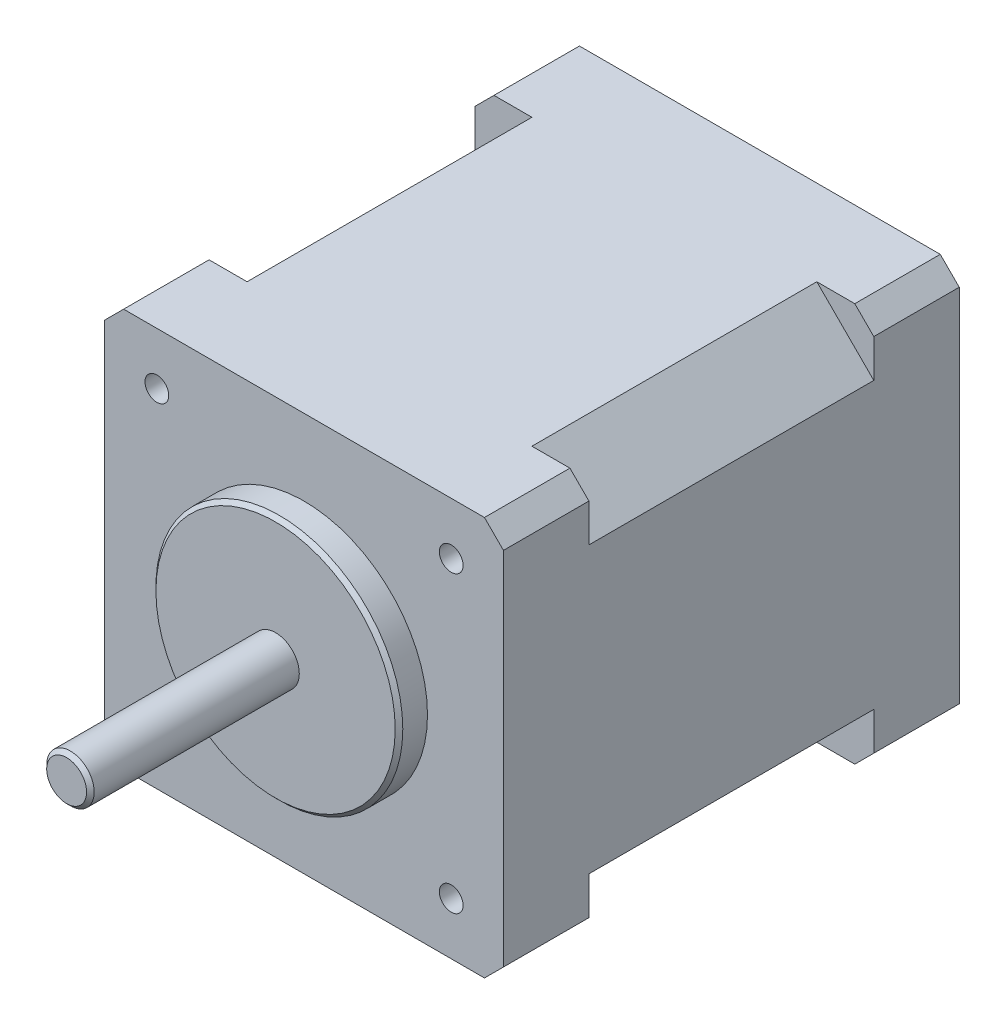
ISO-10303-21;
HEADER;
FILE_DESCRIPTION(('STEP AP214'),'2;1');
FILE_NAME('part.step','',(''),(''),'','','');
FILE_SCHEMA(('AUTOMOTIVE_DESIGN { 1 0 10303 214 1 1 1 1 }'));
ENDSEC;
DATA;
#1=APPLICATION_CONTEXT('core data for automotive mechanical design processes');
#2=APPLICATION_PROTOCOL_DEFINITION('international standard','automotive_design',2000,#1);
#3=PRODUCT_CONTEXT('',#1,'mechanical');
#4=PRODUCT('Part','Part','',(#3));
#5=PRODUCT_RELATED_PRODUCT_CATEGORY('part','',(#4));
#6=PRODUCT_DEFINITION_FORMATION('','',#4);
#7=PRODUCT_DEFINITION_CONTEXT('part definition',#1,'design');
#8=PRODUCT_DEFINITION('design','',#6,#7);
#9=PRODUCT_DEFINITION_SHAPE('','',#8);
#10=(LENGTH_UNIT() NAMED_UNIT(*) SI_UNIT(.MILLI.,.METRE.));
#11=(NAMED_UNIT(*) PLANE_ANGLE_UNIT() SI_UNIT($,.RADIAN.));
#12=(NAMED_UNIT(*) SI_UNIT($,.STERADIAN.) SOLID_ANGLE_UNIT());
#13=UNCERTAINTY_MEASURE_WITH_UNIT(LENGTH_MEASURE(1.E-05),#10,'distance_accuracy_value','');
#14=(GEOMETRIC_REPRESENTATION_CONTEXT(3) GLOBAL_UNCERTAINTY_ASSIGNED_CONTEXT((#13)) GLOBAL_UNIT_ASSIGNED_CONTEXT((#10,
#11,#12)) REPRESENTATION_CONTEXT('',''));
#15=CARTESIAN_POINT('',(0.,0.,0.));
#16=DIRECTION('',(0.,0.,1.));
#17=DIRECTION('',(1.,0.,0.));
#18=AXIS2_PLACEMENT_3D('',#15,#16,#17);
#19=CARTESIAN_POINT('',(-21.,-21.,48.));
#20=DIRECTION('',(0.,1.,0.));
#21=DIRECTION('',(0.,0.,1.));
#22=AXIS2_PLACEMENT_3D('',#19,#20,#21);
#23=PLANE('',#22);
#24=DIRECTION('',(-1.,0.,0.));
#25=VECTOR('',#24,1.);
#26=CARTESIAN_POINT('',(-21.,-21.,39.));
#27=LINE('',#26,#25);
#28=CARTESIAN_POINT('',(-15.,-21.,39.));
#29=VERTEX_POINT('',#28);
#30=CARTESIAN_POINT('',(-19.,-21.,39.));
#31=VERTEX_POINT('',#30);
#32=EDGE_CURVE('E208',#29,#31,#27,.T.);
#33=ORIENTED_EDGE('',*,*,#32,.F.);
#34=DIRECTION('',(0.,0.,-1.));
#35=VECTOR('',#34,1.);
#36=CARTESIAN_POINT('',(-15.,-21.,39.));
#37=LINE('',#36,#35);
#38=CARTESIAN_POINT('',(-15.,-21.,9.));
#39=VERTEX_POINT('',#38);
#40=EDGE_CURVE('E215',#29,#39,#37,.T.);
#41=ORIENTED_EDGE('',*,*,#40,.T.);
#42=DIRECTION('',(-1.,0.,0.));
#43=VECTOR('',#42,1.);
#44=CARTESIAN_POINT('',(-21.,-21.,9.));
#45=LINE('',#44,#43);
#46=CARTESIAN_POINT('',(-19.,-21.,9.));
#47=VERTEX_POINT('',#46);
#48=EDGE_CURVE('E411',#39,#47,#45,.T.);
#49=ORIENTED_EDGE('',*,*,#48,.T.);
#50=DIRECTION('',(0.,0.,-1.));
#51=VECTOR('',#50,1.);
#52=CARTESIAN_POINT('',(-19.,-21.,48.));
#53=LINE('',#52,#51);
#54=CARTESIAN_POINT('',(-19.,-21.,0.));
#55=VERTEX_POINT('',#54);
#56=EDGE_CURVE('E340',#47,#55,#53,.T.);
#57=ORIENTED_EDGE('',*,*,#56,.T.);
#58=DIRECTION('',(1.,0.,0.));
#59=VECTOR('',#58,1.);
#60=CARTESIAN_POINT('',(-21.,-21.,0.));
#61=LINE('',#60,#59);
#62=CARTESIAN_POINT('',(19.,-21.,0.));
#63=VERTEX_POINT('',#62);
#64=EDGE_CURVE('E329',#55,#63,#61,.T.);
#65=ORIENTED_EDGE('',*,*,#64,.T.);
#66=DIRECTION('',(0.,0.,1.));
#67=VECTOR('',#66,1.);
#68=CARTESIAN_POINT('',(19.,-21.,48.));
#69=LINE('',#68,#67);
#70=CARTESIAN_POINT('',(19.,-21.,9.));
#71=VERTEX_POINT('',#70);
#72=EDGE_CURVE('E337',#63,#71,#69,.T.);
#73=ORIENTED_EDGE('',*,*,#72,.T.);
#74=DIRECTION('',(-1.,0.,0.));
#75=VECTOR('',#74,1.);
#76=CARTESIAN_POINT('',(15.,-21.,9.));
#77=LINE('',#76,#75);
#78=CARTESIAN_POINT('',(15.,-21.,9.));
#79=VERTEX_POINT('',#78);
#80=EDGE_CURVE('E60',#71,#79,#77,.T.);
#81=ORIENTED_EDGE('',*,*,#80,.T.);
#82=DIRECTION('',(0.,0.,-1.));
#83=VECTOR('',#82,1.);
#84=CARTESIAN_POINT('',(15.,-21.,39.));
#85=LINE('',#84,#83);
#86=CARTESIAN_POINT('',(15.,-21.,39.));
#87=VERTEX_POINT('',#86);
#88=EDGE_CURVE('E232',#87,#79,#85,.T.);
#89=ORIENTED_EDGE('',*,*,#88,.F.);
#90=DIRECTION('',(-1.,0.,0.));
#91=VECTOR('',#90,1.);
#92=CARTESIAN_POINT('',(15.,-21.,39.));
#93=LINE('',#92,#91);
#94=CARTESIAN_POINT('',(19.,-21.,39.));
#95=VERTEX_POINT('',#94);
#96=EDGE_CURVE('E226',#95,#87,#93,.T.);
#97=ORIENTED_EDGE('',*,*,#96,.F.);
#98=CARTESIAN_POINT('',(19.,-21.,48.));
#99=VERTEX_POINT('',#98);
#100=EDGE_CURVE('E326',#95,#99,#69,.T.);
#101=ORIENTED_EDGE('',*,*,#100,.T.);
#102=DIRECTION('',(1.,0.,0.));
#103=VECTOR('',#102,1.);
#104=CARTESIAN_POINT('',(-21.,-21.,48.));
#105=LINE('',#104,#103);
#106=CARTESIAN_POINT('',(-19.,-21.,48.));
#107=VERTEX_POINT('',#106);
#108=EDGE_CURVE('E316',#107,#99,#105,.T.);
#109=ORIENTED_EDGE('',*,*,#108,.F.);
#110=EDGE_CURVE('E341',#107,#31,#53,.T.);
#111=ORIENTED_EDGE('',*,*,#110,.T.);
#112=EDGE_LOOP('',(#33,#41,#49,#57,#65,#73,#81,#89,#97,#101,#109,#111));
#113=FACE_BOUND('',#112,.T.);
#114=ADVANCED_FACE('F37',(#113),#23,.F.);
#115=CARTESIAN_POINT('',(-21.,21.,48.));
#116=DIRECTION('',(1.,0.,0.));
#117=DIRECTION('',(0.,1.,0.));
#118=AXIS2_PLACEMENT_3D('',#115,#116,#117);
#119=PLANE('',#118);
#120=DIRECTION('',(0.,1.,0.));
#121=VECTOR('',#120,1.);
#122=CARTESIAN_POINT('',(-21.,-15.,39.));
#123=LINE('',#122,#121);
#124=CARTESIAN_POINT('',(-21.,-19.,39.));
#125=VERTEX_POINT('',#124);
#126=CARTESIAN_POINT('',(-21.,-15.,39.));
#127=VERTEX_POINT('',#126);
#128=EDGE_CURVE('E200',#125,#127,#123,.T.);
#129=ORIENTED_EDGE('',*,*,#128,.F.);
#130=DIRECTION('',(0.,0.,1.));
#131=VECTOR('',#130,1.);
#132=CARTESIAN_POINT('',(-21.,-19.,48.));
#133=LINE('',#132,#131);
#134=CARTESIAN_POINT('',(-21.,-19.,48.));
#135=VERTEX_POINT('',#134);
#136=EDGE_CURVE('E356',#125,#135,#133,.T.);
#137=ORIENTED_EDGE('',*,*,#136,.T.);
#138=DIRECTION('',(0.,-1.,0.));
#139=VECTOR('',#138,1.);
#140=CARTESIAN_POINT('',(-21.,21.,48.));
#141=LINE('',#140,#139);
#142=CARTESIAN_POINT('',(-21.,19.,48.));
#143=VERTEX_POINT('',#142);
#144=EDGE_CURVE('E313',#143,#135,#141,.T.);
#145=ORIENTED_EDGE('',*,*,#144,.F.);
#146=DIRECTION('',(0.,0.,-1.));
#147=VECTOR('',#146,1.);
#148=CARTESIAN_POINT('',(-21.,19.,48.));
#149=LINE('',#148,#147);
#150=CARTESIAN_POINT('',(-21.,19.,39.));
#151=VERTEX_POINT('',#150);
#152=EDGE_CURVE('E353',#143,#151,#149,.T.);
#153=ORIENTED_EDGE('',*,*,#152,.T.);
#154=DIRECTION('',(0.,1.,0.));
#155=VECTOR('',#154,1.);
#156=CARTESIAN_POINT('',(-21.,15.,39.));
#157=LINE('',#156,#155);
#158=CARTESIAN_POINT('',(-21.,15.,39.));
#159=VERTEX_POINT('',#158);
#160=EDGE_CURVE('E249',#159,#151,#157,.T.);
#161=ORIENTED_EDGE('',*,*,#160,.F.);
#162=DIRECTION('',(0.,0.,-1.));
#163=VECTOR('',#162,1.);
#164=CARTESIAN_POINT('',(-21.,15.,39.));
#165=LINE('',#164,#163);
#166=CARTESIAN_POINT('',(-21.,15.,9.));
#167=VERTEX_POINT('',#166);
#168=EDGE_CURVE('E258',#159,#167,#165,.T.);
#169=ORIENTED_EDGE('',*,*,#168,.T.);
#170=DIRECTION('',(0.,1.,0.));
#171=VECTOR('',#170,1.);
#172=CARTESIAN_POINT('',(-21.,15.,9.));
#173=LINE('',#172,#171);
#174=CARTESIAN_POINT('',(-21.,19.,9.));
#175=VERTEX_POINT('',#174);
#176=EDGE_CURVE('E246',#167,#175,#173,.T.);
#177=ORIENTED_EDGE('',*,*,#176,.T.);
#178=CARTESIAN_POINT('',(-21.,19.,0.));
#179=VERTEX_POINT('',#178);
#180=EDGE_CURVE('E352',#175,#179,#149,.T.);
#181=ORIENTED_EDGE('',*,*,#180,.T.);
#182=DIRECTION('',(0.,-1.,0.));
#183=VECTOR('',#182,1.);
#184=CARTESIAN_POINT('',(-21.,21.,0.));
#185=LINE('',#184,#183);
#186=CARTESIAN_POINT('',(-21.,-19.,0.));
#187=VERTEX_POINT('',#186);
#188=EDGE_CURVE('E312',#179,#187,#185,.T.);
#189=ORIENTED_EDGE('',*,*,#188,.T.);
#190=CARTESIAN_POINT('',(-21.,-19.,9.));
#191=VERTEX_POINT('',#190);
#192=EDGE_CURVE('E357',#187,#191,#133,.T.);
#193=ORIENTED_EDGE('',*,*,#192,.T.);
#194=DIRECTION('',(0.,1.,0.));
#195=VECTOR('',#194,1.);
#196=CARTESIAN_POINT('',(-21.,-15.,9.));
#197=LINE('',#196,#195);
#198=CARTESIAN_POINT('',(-21.,-15.,9.));
#199=VERTEX_POINT('',#198);
#200=EDGE_CURVE('E52',#191,#199,#197,.T.);
#201=ORIENTED_EDGE('',*,*,#200,.T.);
#202=DIRECTION('',(0.,0.,-1.));
#203=VECTOR('',#202,1.);
#204=CARTESIAN_POINT('',(-21.,-15.,39.));
#205=LINE('',#204,#203);
#206=EDGE_CURVE('E213',#127,#199,#205,.T.);
#207=ORIENTED_EDGE('',*,*,#206,.F.);
#208=EDGE_LOOP('',(#129,#137,#145,#153,#161,#169,#177,#181,#189,#193,#201,#207));
#209=FACE_BOUND('',#208,.T.);
#210=ADVANCED_FACE('F217',(#209),#119,.F.);
#211=CARTESIAN_POINT('',(-19.,-21.,48.));
#212=DIRECTION('',(0.707106781186547,0.707106781186547,0.));
#213=DIRECTION('',(0.,0.,-1.));
#214=AXIS2_PLACEMENT_3D('',#211,#212,#213);
#215=PLANE('',#214);
#216=ORIENTED_EDGE('',*,*,#136,.F.);
#217=DIRECTION('',(-0.707106781186548,0.707106781186548,0.));
#218=VECTOR('',#217,1.);
#219=CARTESIAN_POINT('',(-19.,-21.,39.));
#220=LINE('',#219,#218);
#221=EDGE_CURVE('E11',#125,#31,#220,.F.);
#222=ORIENTED_EDGE('',*,*,#221,.T.);
#223=ORIENTED_EDGE('',*,*,#110,.F.);
#224=DIRECTION('',(-0.707106781186548,0.707106781186548,0.));
#225=VECTOR('',#224,1.);
#226=CARTESIAN_POINT('',(-20.,-20.,48.));
#227=LINE('',#226,#225);
#228=EDGE_CURVE('E365',#135,#107,#227,.F.);
#229=ORIENTED_EDGE('',*,*,#228,.F.);
#230=EDGE_LOOP('',(#216,#222,#223,#229));
#231=FACE_BOUND('',#230,.T.);
#232=ADVANCED_FACE('F474',(#231),#215,.F.);
#233=CARTESIAN_POINT('',(21.,21.,48.));
#234=DIRECTION('',(-1.,0.,0.));
#235=DIRECTION('',(0.,-1.,0.));
#236=AXIS2_PLACEMENT_3D('',#233,#234,#235);
#237=PLANE('',#236);
#238=DIRECTION('',(0.,-1.,0.));
#239=VECTOR('',#238,1.);
#240=CARTESIAN_POINT('',(21.,-21.,39.));
#241=LINE('',#240,#239);
#242=CARTESIAN_POINT('',(21.,-15.,39.));
#243=VERTEX_POINT('',#242);
#244=CARTESIAN_POINT('',(21.,-19.,39.));
#245=VERTEX_POINT('',#244);
#246=EDGE_CURVE('E224',#243,#245,#241,.T.);
#247=ORIENTED_EDGE('',*,*,#246,.F.);
#248=DIRECTION('',(0.,0.,-1.));
#249=VECTOR('',#248,1.);
#250=CARTESIAN_POINT('',(21.,-15.,39.));
#251=LINE('',#250,#249);
#252=CARTESIAN_POINT('',(21.,-15.,9.));
#253=VERTEX_POINT('',#252);
#254=EDGE_CURVE('E238',#243,#253,#251,.T.);
#255=ORIENTED_EDGE('',*,*,#254,.T.);
#256=DIRECTION('',(0.,-1.,0.));
#257=VECTOR('',#256,1.);
#258=CARTESIAN_POINT('',(21.,-21.,9.));
#259=LINE('',#258,#257);
#260=CARTESIAN_POINT('',(21.,-19.,9.));
#261=VERTEX_POINT('',#260);
#262=EDGE_CURVE('E220',#253,#261,#259,.T.);
#263=ORIENTED_EDGE('',*,*,#262,.T.);
#264=DIRECTION('',(0.,0.,-1.));
#265=VECTOR('',#264,1.);
#266=CARTESIAN_POINT('',(21.,-19.,48.));
#267=LINE('',#266,#265);
#268=CARTESIAN_POINT('',(21.,-19.,0.));
#269=VERTEX_POINT('',#268);
#270=EDGE_CURVE('E371',#261,#269,#267,.T.);
#271=ORIENTED_EDGE('',*,*,#270,.T.);
#272=DIRECTION('',(0.,1.,0.));
#273=VECTOR('',#272,1.);
#274=CARTESIAN_POINT('',(21.,21.,0.));
#275=LINE('',#274,#273);
#276=CARTESIAN_POINT('',(21.,19.,0.));
#277=VERTEX_POINT('',#276);
#278=EDGE_CURVE('E332',#269,#277,#275,.T.);
#279=ORIENTED_EDGE('',*,*,#278,.T.);
#280=DIRECTION('',(0.,0.,1.));
#281=VECTOR('',#280,1.);
#282=CARTESIAN_POINT('',(21.,19.,48.));
#283=LINE('',#282,#281);
#284=CARTESIAN_POINT('',(21.,19.,9.));
#285=VERTEX_POINT('',#284);
#286=EDGE_CURVE('E368',#277,#285,#283,.T.);
#287=ORIENTED_EDGE('',*,*,#286,.T.);
#288=DIRECTION('',(0.,-1.,0.));
#289=VECTOR('',#288,1.);
#290=CARTESIAN_POINT('',(21.,21.,9.));
#291=LINE('',#290,#289);
#292=CARTESIAN_POINT('',(21.,15.,9.));
#293=VERTEX_POINT('',#292);
#294=EDGE_CURVE('E261',#285,#293,#291,.T.);
#295=ORIENTED_EDGE('',*,*,#294,.T.);
#296=DIRECTION('',(0.,0.,-1.));
#297=VECTOR('',#296,1.);
#298=CARTESIAN_POINT('',(21.,15.,39.));
#299=LINE('',#298,#297);
#300=CARTESIAN_POINT('',(21.,15.,39.));
#301=VERTEX_POINT('',#300);
#302=EDGE_CURVE('E271',#301,#293,#299,.T.);
#303=ORIENTED_EDGE('',*,*,#302,.F.);
#304=DIRECTION('',(0.,-1.,0.));
#305=VECTOR('',#304,1.);
#306=CARTESIAN_POINT('',(21.,21.,39.));
#307=LINE('',#306,#305);
#308=CARTESIAN_POINT('',(21.,19.,39.));
#309=VERTEX_POINT('',#308);
#310=EDGE_CURVE('E263',#309,#301,#307,.T.);
#311=ORIENTED_EDGE('',*,*,#310,.F.);
#312=CARTESIAN_POINT('',(21.,19.,48.));
#313=VERTEX_POINT('',#312);
#314=EDGE_CURVE('E367',#309,#313,#283,.T.);
#315=ORIENTED_EDGE('',*,*,#314,.T.);
#316=DIRECTION('',(0.,1.,0.));
#317=VECTOR('',#316,1.);
#318=CARTESIAN_POINT('',(21.,21.,48.));
#319=LINE('',#318,#317);
#320=CARTESIAN_POINT('',(21.,-19.,48.));
#321=VERTEX_POINT('',#320);
#322=EDGE_CURVE('E320',#321,#313,#319,.T.);
#323=ORIENTED_EDGE('',*,*,#322,.F.);
#324=EDGE_CURVE('E372',#321,#245,#267,.T.);
#325=ORIENTED_EDGE('',*,*,#324,.T.);
#326=EDGE_LOOP('',(#247,#255,#263,#271,#279,#287,#295,#303,#311,#315,#323,#325));
#327=FACE_BOUND('',#326,.T.);
#328=ADVANCED_FACE('F432',(#327),#237,.F.);
#329=CARTESIAN_POINT('',(21.,-19.,48.));
#330=DIRECTION('',(-0.707106781186548,0.707106781186548,0.));
#331=DIRECTION('',(0.,0.,-1.));
#332=AXIS2_PLACEMENT_3D('',#329,#330,#331);
#333=PLANE('',#332);
#334=ORIENTED_EDGE('',*,*,#100,.F.);
#335=DIRECTION('',(-0.707106781186548,-0.707106781186548,0.));
#336=VECTOR('',#335,1.);
#337=CARTESIAN_POINT('',(21.,-19.,39.));
#338=LINE('',#337,#336);
#339=EDGE_CURVE('E407',#95,#245,#338,.F.);
#340=ORIENTED_EDGE('',*,*,#339,.T.);
#341=ORIENTED_EDGE('',*,*,#324,.F.);
#342=DIRECTION('',(-0.707106781186548,-0.707106781186548,0.));
#343=VECTOR('',#342,1.);
#344=CARTESIAN_POINT('',(20.,-20.,48.));
#345=LINE('',#344,#343);
#346=EDGE_CURVE('E363',#99,#321,#345,.F.);
#347=ORIENTED_EDGE('',*,*,#346,.F.);
#348=EDGE_LOOP('',(#334,#340,#341,#347));
#349=FACE_BOUND('',#348,.T.);
#350=ADVANCED_FACE('F444',(#349),#333,.F.);
#351=CARTESIAN_POINT('',(-21.,19.,48.));
#352=DIRECTION('',(0.707106781186547,-0.707106781186547,0.));
#353=DIRECTION('',(0.,0.,-1.));
#354=AXIS2_PLACEMENT_3D('',#351,#352,#353);
#355=PLANE('',#354);
#356=ORIENTED_EDGE('',*,*,#180,.F.);
#357=DIRECTION('',(-0.707106781186548,-0.707106781186548,0.));
#358=VECTOR('',#357,1.);
#359=CARTESIAN_POINT('',(-21.,19.,9.));
#360=LINE('',#359,#358);
#361=CARTESIAN_POINT('',(-19.,21.,9.));
#362=VERTEX_POINT('',#361);
#363=EDGE_CURVE('E400',#175,#362,#360,.F.);
#364=ORIENTED_EDGE('',*,*,#363,.T.);
#365=DIRECTION('',(0.,0.,1.));
#366=VECTOR('',#365,1.);
#367=CARTESIAN_POINT('',(-19.,21.,48.));
#368=LINE('',#367,#366);
#369=CARTESIAN_POINT('',(-19.,21.,0.));
#370=VERTEX_POINT('',#369);
#371=EDGE_CURVE('E380',#370,#362,#368,.T.);
#372=ORIENTED_EDGE('',*,*,#371,.F.);
#373=DIRECTION('',(-0.707106781186548,-0.707106781186548,0.));
#374=VECTOR('',#373,1.);
#375=CARTESIAN_POINT('',(-21.,19.,0.));
#376=LINE('',#375,#374);
#377=EDGE_CURVE('E346',#179,#370,#376,.F.);
#378=ORIENTED_EDGE('',*,*,#377,.F.);
#379=EDGE_LOOP('',(#356,#364,#372,#378));
#380=FACE_BOUND('',#379,.T.);
#381=ADVANCED_FACE('F668',(#380),#355,.F.);
#382=CARTESIAN_POINT('',(19.,21.,48.));
#383=DIRECTION('',(-0.707106781186547,-0.707106781186547,0.));
#384=DIRECTION('',(0.,0.,-1.));
#385=AXIS2_PLACEMENT_3D('',#382,#383,#384);
#386=PLANE('',#385);
#387=DIRECTION('',(0.,0.,-1.));
#388=VECTOR('',#387,1.);
#389=CARTESIAN_POINT('',(19.,21.,48.));
#390=LINE('',#389,#388);
#391=CARTESIAN_POINT('',(19.,21.,9.));
#392=VERTEX_POINT('',#391);
#393=CARTESIAN_POINT('',(19.,21.,0.));
#394=VERTEX_POINT('',#393);
#395=EDGE_CURVE('E375',#392,#394,#390,.T.);
#396=ORIENTED_EDGE('',*,*,#395,.F.);
#397=DIRECTION('',(-0.707106781186548,0.707106781186548,0.));
#398=VECTOR('',#397,1.);
#399=CARTESIAN_POINT('',(19.,21.,9.));
#400=LINE('',#399,#398);
#401=EDGE_CURVE('E395',#392,#285,#400,.F.);
#402=ORIENTED_EDGE('',*,*,#401,.T.);
#403=ORIENTED_EDGE('',*,*,#286,.F.);
#404=DIRECTION('',(-0.707106781186548,0.707106781186548,0.));
#405=VECTOR('',#404,1.);
#406=CARTESIAN_POINT('',(19.,21.,0.));
#407=LINE('',#406,#405);
#408=EDGE_CURVE('E344',#394,#277,#407,.F.);
#409=ORIENTED_EDGE('',*,*,#408,.F.);
#410=EDGE_LOOP('',(#396,#402,#403,#409));
#411=FACE_BOUND('',#410,.T.);
#412=ADVANCED_FACE('F510',(#411),#386,.F.);
#413=CARTESIAN_POINT('',(0.,0.,51.));
#414=DIRECTION('',(0.,0.,1.));
#415=DIRECTION('',(1.,0.,0.));
#416=AXIS2_PLACEMENT_3D('',#413,#414,#415);
#417=PLANE('',#416);
#418=CARTESIAN_POINT('',(0.,0.,51.));
#419=DIRECTION('',(0.,0.,1.));
#420=DIRECTION('',(1.,0.,0.));
#421=AXIS2_PLACEMENT_3D('',#418,#419,#420);
#422=CIRCLE('',#421,12.6);
#423=CARTESIAN_POINT('',(12.6,0.,51.));
#424=VERTEX_POINT('',#423);
#425=EDGE_CURVE('E389',#424,#424,#422,.T.);
#426=ORIENTED_EDGE('',*,*,#425,.T.);
#427=EDGE_LOOP('',(#426));
#428=FACE_BOUND('',#427,.T.);
#429=CARTESIAN_POINT('',(0.,0.,51.));
#430=DIRECTION('',(0.,0.,1.));
#431=DIRECTION('',(1.,0.,0.));
#432=AXIS2_PLACEMENT_3D('',#429,#430,#431);
#433=CIRCLE('',#432,2.5);
#434=CARTESIAN_POINT('',(2.5,0.,51.));
#435=VERTEX_POINT('',#434);
#436=EDGE_CURVE('E281',#435,#435,#433,.T.);
#437=ORIENTED_EDGE('',*,*,#436,.F.);
#438=EDGE_LOOP('',(#437));
#439=FACE_BOUND('',#438,.T.);
#440=ADVANCED_FACE('F501',(#428,#439),#417,.T.);
#441=CARTESIAN_POINT('',(0.,0.,48.));
#442=DIRECTION('',(0.,0.,1.));
#443=DIRECTION('',(1.,0.,0.));
#444=AXIS2_PLACEMENT_3D('',#441,#442,#443);
#445=PLANE('',#444);
#446=CARTESIAN_POINT('',(-15.5,15.5,48.));
#447=DIRECTION('',(0.,0.,1.));
#448=DIRECTION('',(1.,0.,0.));
#449=AXIS2_PLACEMENT_3D('',#446,#447,#448);
#450=CIRCLE('',#449,1.24999999999999);
#451=CARTESIAN_POINT('',(-14.25,15.5,48.));
#452=VERTEX_POINT('',#451);
#453=EDGE_CURVE('E285',#452,#452,#450,.T.);
#454=ORIENTED_EDGE('',*,*,#453,.F.);
#455=EDGE_LOOP('',(#454));
#456=FACE_BOUND('',#455,.T.);
#457=CARTESIAN_POINT('',(-15.5,-15.5,48.));
#458=DIRECTION('',(0.,0.,1.));
#459=DIRECTION('',(1.,0.,0.));
#460=AXIS2_PLACEMENT_3D('',#457,#458,#459);
#461=CIRCLE('',#460,1.24999999999999);
#462=CARTESIAN_POINT('',(-14.25,-15.5,48.));
#463=VERTEX_POINT('',#462);
#464=EDGE_CURVE('E291',#463,#463,#461,.T.);
#465=ORIENTED_EDGE('',*,*,#464,.F.);
#466=EDGE_LOOP('',(#465));
#467=FACE_BOUND('',#466,.T.);
#468=CARTESIAN_POINT('',(15.5,-15.5,48.));
#469=DIRECTION('',(0.,0.,1.));
#470=DIRECTION('',(1.,0.,0.));
#471=AXIS2_PLACEMENT_3D('',#468,#469,#470);
#472=CIRCLE('',#471,1.24999999999999);
#473=CARTESIAN_POINT('',(16.75,-15.5,48.));
#474=VERTEX_POINT('',#473);
#475=EDGE_CURVE('E297',#474,#474,#472,.T.);
#476=ORIENTED_EDGE('',*,*,#475,.F.);
#477=EDGE_LOOP('',(#476));
#478=FACE_BOUND('',#477,.T.);
#479=CARTESIAN_POINT('',(15.5,15.5,48.));
#480=DIRECTION('',(0.,0.,1.));
#481=DIRECTION('',(1.,0.,0.));
#482=AXIS2_PLACEMENT_3D('',#479,#480,#481);
#483=CIRCLE('',#482,1.24999999999999);
#484=CARTESIAN_POINT('',(16.75,15.5,48.));
#485=VERTEX_POINT('',#484);
#486=EDGE_CURVE('E303',#485,#485,#483,.T.);
#487=ORIENTED_EDGE('',*,*,#486,.F.);
#488=EDGE_LOOP('',(#487));
#489=FACE_BOUND('',#488,.T.);
#490=ORIENTED_EDGE('',*,*,#144,.T.);
#491=ORIENTED_EDGE('',*,*,#228,.T.);
#492=ORIENTED_EDGE('',*,*,#108,.T.);
#493=ORIENTED_EDGE('',*,*,#346,.T.);
#494=ORIENTED_EDGE('',*,*,#322,.T.);
#495=DIRECTION('',(0.707106781186548,-0.707106781186548,0.));
#496=VECTOR('',#495,1.);
#497=CARTESIAN_POINT('',(20.,20.,48.));
#498=LINE('',#497,#496);
#499=CARTESIAN_POINT('',(19.,21.,48.));
#500=VERTEX_POINT('',#499);
#501=EDGE_CURVE('E359',#313,#500,#498,.F.);
#502=ORIENTED_EDGE('',*,*,#501,.T.);
#503=DIRECTION('',(-1.,0.,0.));
#504=VECTOR('',#503,1.);
#505=CARTESIAN_POINT('',(-21.,21.,48.));
#506=LINE('',#505,#504);
#507=CARTESIAN_POINT('',(-19.,21.,48.));
#508=VERTEX_POINT('',#507);
#509=EDGE_CURVE('E323',#500,#508,#506,.T.);
#510=ORIENTED_EDGE('',*,*,#509,.T.);
#511=DIRECTION('',(0.707106781186548,0.707106781186548,0.));
#512=VECTOR('',#511,1.);
#513=CARTESIAN_POINT('',(-20.,20.,48.));
#514=LINE('',#513,#512);
#515=EDGE_CURVE('E361',#508,#143,#514,.F.);
#516=ORIENTED_EDGE('',*,*,#515,.T.);
#517=EDGE_LOOP('',(#490,#491,#492,#493,#494,#502,#510,#516));
#518=FACE_BOUND('',#517,.T.);
#519=CARTESIAN_POINT('',(0.,0.,48.));
#520=DIRECTION('',(0.,0.,1.));
#521=DIRECTION('',(1.,0.,0.));
#522=AXIS2_PLACEMENT_3D('',#519,#520,#521);
#523=CIRCLE('',#522,13.);
#524=CARTESIAN_POINT('',(13.,0.,48.));
#525=VERTEX_POINT('',#524);
#526=EDGE_CURVE('E309',#525,#525,#523,.T.);
#527=ORIENTED_EDGE('',*,*,#526,.F.);
#528=EDGE_LOOP('',(#527));
#529=FACE_BOUND('',#528,.T.);
#530=ADVANCED_FACE('F448',(#456,#467,#478,#489,#518,#529),#445,.T.);
#531=CARTESIAN_POINT('',(-21.,21.,48.));
#532=DIRECTION('',(0.,-1.,0.));
#533=DIRECTION('',(1.,0.,0.));
#534=AXIS2_PLACEMENT_3D('',#531,#532,#533);
#535=PLANE('',#534);
#536=DIRECTION('',(0.,0.,-1.));
#537=VECTOR('',#536,1.);
#538=CARTESIAN_POINT('',(-15.,21.,39.));
#539=LINE('',#538,#537);
#540=CARTESIAN_POINT('',(-15.,21.,39.));
#541=VERTEX_POINT('',#540);
#542=CARTESIAN_POINT('',(-15.,21.,9.));
#543=VERTEX_POINT('',#542);
#544=EDGE_CURVE('E251',#541,#543,#539,.T.);
#545=ORIENTED_EDGE('',*,*,#544,.F.);
#546=DIRECTION('',(1.,0.,0.));
#547=VECTOR('',#546,1.);
#548=CARTESIAN_POINT('',(-21.,21.,39.));
#549=LINE('',#548,#547);
#550=CARTESIAN_POINT('',(-19.,21.,39.));
#551=VERTEX_POINT('',#550);
#552=EDGE_CURVE('E243',#551,#541,#549,.T.);
#553=ORIENTED_EDGE('',*,*,#552,.F.);
#554=EDGE_CURVE('E379',#551,#508,#368,.T.);
#555=ORIENTED_EDGE('',*,*,#554,.T.);
#556=ORIENTED_EDGE('',*,*,#509,.F.);
#557=CARTESIAN_POINT('',(19.,21.,39.));
#558=VERTEX_POINT('',#557);
#559=EDGE_CURVE('E376',#500,#558,#390,.T.);
#560=ORIENTED_EDGE('',*,*,#559,.T.);
#561=DIRECTION('',(1.,0.,0.));
#562=VECTOR('',#561,1.);
#563=CARTESIAN_POINT('',(15.,21.,39.));
#564=LINE('',#563,#562);
#565=CARTESIAN_POINT('',(15.,21.,39.));
#566=VERTEX_POINT('',#565);
#567=EDGE_CURVE('E269',#566,#558,#564,.T.);
#568=ORIENTED_EDGE('',*,*,#567,.F.);
#569=DIRECTION('',(0.,0.,-1.));
#570=VECTOR('',#569,1.);
#571=CARTESIAN_POINT('',(15.,21.,39.));
#572=LINE('',#571,#570);
#573=CARTESIAN_POINT('',(15.,21.,9.));
#574=VERTEX_POINT('',#573);
#575=EDGE_CURVE('E278',#566,#574,#572,.T.);
#576=ORIENTED_EDGE('',*,*,#575,.T.);
#577=DIRECTION('',(1.,0.,0.));
#578=VECTOR('',#577,1.);
#579=CARTESIAN_POINT('',(15.,21.,9.));
#580=LINE('',#579,#578);
#581=EDGE_CURVE('E266',#574,#392,#580,.T.);
#582=ORIENTED_EDGE('',*,*,#581,.T.);
#583=ORIENTED_EDGE('',*,*,#395,.T.);
#584=DIRECTION('',(-1.,0.,0.));
#585=VECTOR('',#584,1.);
#586=CARTESIAN_POINT('',(-21.,21.,0.));
#587=LINE('',#586,#585);
#588=EDGE_CURVE('E317',#394,#370,#587,.T.);
#589=ORIENTED_EDGE('',*,*,#588,.T.);
#590=ORIENTED_EDGE('',*,*,#371,.T.);
#591=DIRECTION('',(1.,0.,0.));
#592=VECTOR('',#591,1.);
#593=CARTESIAN_POINT('',(-21.,21.,9.));
#594=LINE('',#593,#592);
#595=EDGE_CURVE('E241',#362,#543,#594,.T.);
#596=ORIENTED_EDGE('',*,*,#595,.T.);
#597=EDGE_LOOP('',(#545,#553,#555,#556,#560,#568,#576,#582,#583,#589,#590,#596));
#598=FACE_BOUND('',#597,.T.);
#599=ADVANCED_FACE('F462',(#598),#535,.F.);
#600=CARTESIAN_POINT('',(0.,0.,0.));
#601=DIRECTION('',(0.,0.,1.));
#602=DIRECTION('',(1.,0.,0.));
#603=AXIS2_PLACEMENT_3D('',#600,#601,#602);
#604=PLANE('',#603);
#605=CARTESIAN_POINT('',(-15.5,15.5,0.));
#606=DIRECTION('',(0.,0.,1.));
#607=DIRECTION('',(1.,0.,0.));
#608=AXIS2_PLACEMENT_3D('',#605,#606,#607);
#609=CIRCLE('',#608,1.24999999999999);
#610=CARTESIAN_POINT('',(-14.25,15.5,0.));
#611=VERTEX_POINT('',#610);
#612=EDGE_CURVE('E288',#611,#611,#609,.T.);
#613=ORIENTED_EDGE('',*,*,#612,.T.);
#614=EDGE_LOOP('',(#613));
#615=FACE_BOUND('',#614,.T.);
#616=CARTESIAN_POINT('',(-15.5,-15.5,0.));
#617=DIRECTION('',(0.,0.,1.));
#618=DIRECTION('',(1.,0.,0.));
#619=AXIS2_PLACEMENT_3D('',#616,#617,#618);
#620=CIRCLE('',#619,1.24999999999999);
#621=CARTESIAN_POINT('',(-14.25,-15.5,0.));
#622=VERTEX_POINT('',#621);
#623=EDGE_CURVE('E294',#622,#622,#620,.T.);
#624=ORIENTED_EDGE('',*,*,#623,.T.);
#625=EDGE_LOOP('',(#624));
#626=FACE_BOUND('',#625,.T.);
#627=CARTESIAN_POINT('',(15.5,-15.5,0.));
#628=DIRECTION('',(0.,0.,1.));
#629=DIRECTION('',(1.,0.,0.));
#630=AXIS2_PLACEMENT_3D('',#627,#628,#629);
#631=CIRCLE('',#630,1.24999999999999);
#632=CARTESIAN_POINT('',(16.75,-15.5,0.));
#633=VERTEX_POINT('',#632);
#634=EDGE_CURVE('E300',#633,#633,#631,.T.);
#635=ORIENTED_EDGE('',*,*,#634,.T.);
#636=EDGE_LOOP('',(#635));
#637=FACE_BOUND('',#636,.T.);
#638=CARTESIAN_POINT('',(15.5,15.5,0.));
#639=DIRECTION('',(0.,0.,1.));
#640=DIRECTION('',(1.,0.,0.));
#641=AXIS2_PLACEMENT_3D('',#638,#639,#640);
#642=CIRCLE('',#641,1.24999999999999);
#643=CARTESIAN_POINT('',(16.75,15.5,0.));
#644=VERTEX_POINT('',#643);
#645=EDGE_CURVE('E306',#644,#644,#642,.T.);
#646=ORIENTED_EDGE('',*,*,#645,.T.);
#647=EDGE_LOOP('',(#646));
#648=FACE_BOUND('',#647,.T.);
#649=ORIENTED_EDGE('',*,*,#64,.F.);
#650=DIRECTION('',(0.707106781186548,-0.707106781186548,0.));
#651=VECTOR('',#650,1.);
#652=CARTESIAN_POINT('',(-19.,-21.,0.));
#653=LINE('',#652,#651);
#654=EDGE_CURVE('E350',#55,#187,#653,.F.);
#655=ORIENTED_EDGE('',*,*,#654,.T.);
#656=ORIENTED_EDGE('',*,*,#188,.F.);
#657=ORIENTED_EDGE('',*,*,#377,.T.);
#658=ORIENTED_EDGE('',*,*,#588,.F.);
#659=ORIENTED_EDGE('',*,*,#408,.T.);
#660=ORIENTED_EDGE('',*,*,#278,.F.);
#661=DIRECTION('',(0.707106781186548,0.707106781186548,0.));
#662=VECTOR('',#661,1.);
#663=CARTESIAN_POINT('',(21.,-19.,0.));
#664=LINE('',#663,#662);
#665=EDGE_CURVE('E348',#269,#63,#664,.F.);
#666=ORIENTED_EDGE('',*,*,#665,.T.);
#667=EDGE_LOOP('',(#649,#655,#656,#657,#658,#659,#660,#666));
#668=FACE_BOUND('',#667,.T.);
#669=ADVANCED_FACE('F422',(#615,#626,#637,#648,#668),#604,.F.);
#670=DIRECTION('',(-0.707106781186548,0.707106781186548,0.));
#671=VECTOR('',#670,1.);
#672=CARTESIAN_POINT('',(-19.,-21.,9.));
#673=LINE('',#672,#671);
#674=EDGE_CURVE('E45',#191,#47,#673,.F.);
#675=ORIENTED_EDGE('',*,*,#674,.F.);
#676=ORIENTED_EDGE('',*,*,#192,.F.);
#677=ORIENTED_EDGE('',*,*,#654,.F.);
#678=ORIENTED_EDGE('',*,*,#56,.F.);
#679=EDGE_LOOP('',(#675,#676,#677,#678));
#680=FACE_BOUND('',#679,.T.);
#681=ADVANCED_FACE('F418',(#680),#215,.F.);
#682=DIRECTION('',(-0.707106781186548,-0.707106781186548,0.));
#683=VECTOR('',#682,1.);
#684=CARTESIAN_POINT('',(21.,-19.,9.));
#685=LINE('',#684,#683);
#686=EDGE_CURVE('E405',#71,#261,#685,.F.);
#687=ORIENTED_EDGE('',*,*,#686,.F.);
#688=ORIENTED_EDGE('',*,*,#72,.F.);
#689=ORIENTED_EDGE('',*,*,#665,.F.);
#690=ORIENTED_EDGE('',*,*,#270,.F.);
#691=EDGE_LOOP('',(#687,#688,#689,#690));
#692=FACE_BOUND('',#691,.T.);
#693=ADVANCED_FACE('F427',(#692),#333,.F.);
#694=DIRECTION('',(-0.707106781186548,-0.707106781186548,0.));
#695=VECTOR('',#694,1.);
#696=CARTESIAN_POINT('',(-21.,19.,39.));
#697=LINE('',#696,#695);
#698=EDGE_CURVE('E403',#151,#551,#697,.F.);
#699=ORIENTED_EDGE('',*,*,#698,.F.);
#700=ORIENTED_EDGE('',*,*,#152,.F.);
#701=ORIENTED_EDGE('',*,*,#515,.F.);
#702=ORIENTED_EDGE('',*,*,#554,.F.);
#703=EDGE_LOOP('',(#699,#700,#701,#702));
#704=FACE_BOUND('',#703,.T.);
#705=ADVANCED_FACE('F468',(#704),#355,.F.);
#706=DIRECTION('',(-0.707106781186548,0.707106781186548,0.));
#707=VECTOR('',#706,1.);
#708=CARTESIAN_POINT('',(19.,21.,39.));
#709=LINE('',#708,#707);
#710=EDGE_CURVE('E398',#558,#309,#709,.F.);
#711=ORIENTED_EDGE('',*,*,#710,.F.);
#712=ORIENTED_EDGE('',*,*,#559,.F.);
#713=ORIENTED_EDGE('',*,*,#501,.F.);
#714=ORIENTED_EDGE('',*,*,#314,.F.);
#715=EDGE_LOOP('',(#711,#712,#713,#714));
#716=FACE_BOUND('',#715,.T.);
#717=ADVANCED_FACE('F456',(#716),#386,.F.);
#718=CARTESIAN_POINT('',(0.,0.,51.));
#719=DIRECTION('',(0.,0.,-1.));
#720=DIRECTION('',(-1.,0.,0.));
#721=AXIS2_PLACEMENT_3D('',#718,#719,#720);
#722=CYLINDRICAL_SURFACE('',#721,13.);
#723=CARTESIAN_POINT('',(0.,0.,50.6));
#724=DIRECTION('',(0.,0.,1.));
#725=DIRECTION('',(1.,0.,0.));
#726=AXIS2_PLACEMENT_3D('',#723,#724,#725);
#727=CIRCLE('',#726,13.);
#728=CARTESIAN_POINT('',(13.,0.,50.6));
#729=VERTEX_POINT('',#728);
#730=EDGE_CURVE('E392',#729,#729,#727,.F.);
#731=ORIENTED_EDGE('',*,*,#730,.T.);
#732=EDGE_LOOP('',(#731));
#733=FACE_BOUND('',#732,.T.);
#734=ORIENTED_EDGE('',*,*,#526,.T.);
#735=EDGE_LOOP('',(#734));
#736=FACE_BOUND('',#735,.T.);
#737=ADVANCED_FACE('F503',(#733,#736),#722,.T.);
#738=CARTESIAN_POINT('',(15.5,15.5,48.));
#739=DIRECTION('',(0.,0.,1.));
#740=DIRECTION('',(1.,0.,0.));
#741=AXIS2_PLACEMENT_3D('',#738,#739,#740);
#742=CYLINDRICAL_SURFACE('',#741,1.24999999999999);
#743=ORIENTED_EDGE('',*,*,#645,.F.);
#744=EDGE_LOOP('',(#743));
#745=FACE_BOUND('',#744,.T.);
#746=ORIENTED_EDGE('',*,*,#486,.T.);
#747=EDGE_LOOP('',(#746));
#748=FACE_BOUND('',#747,.T.);
#749=ADVANCED_FACE('F506',(#745,#748),#742,.F.);
#750=CARTESIAN_POINT('',(15.5,-15.5,48.));
#751=DIRECTION('',(0.,0.,1.));
#752=DIRECTION('',(1.,0.,0.));
#753=AXIS2_PLACEMENT_3D('',#750,#751,#752);
#754=CYLINDRICAL_SURFACE('',#753,1.24999999999999);
#755=ORIENTED_EDGE('',*,*,#634,.F.);
#756=EDGE_LOOP('',(#755));
#757=FACE_BOUND('',#756,.T.);
#758=ORIENTED_EDGE('',*,*,#475,.T.);
#759=EDGE_LOOP('',(#758));
#760=FACE_BOUND('',#759,.T.);
#761=ADVANCED_FACE('F514',(#757,#760),#754,.F.);
#762=CARTESIAN_POINT('',(-15.5,-15.5,48.));
#763=DIRECTION('',(0.,0.,1.));
#764=DIRECTION('',(1.,0.,0.));
#765=AXIS2_PLACEMENT_3D('',#762,#763,#764);
#766=CYLINDRICAL_SURFACE('',#765,1.24999999999999);
#767=ORIENTED_EDGE('',*,*,#623,.F.);
#768=EDGE_LOOP('',(#767));
#769=FACE_BOUND('',#768,.T.);
#770=ORIENTED_EDGE('',*,*,#464,.T.);
#771=EDGE_LOOP('',(#770));
#772=FACE_BOUND('',#771,.T.);
#773=ADVANCED_FACE('F518',(#769,#772),#766,.F.);
#774=CARTESIAN_POINT('',(-15.5,15.5,48.));
#775=DIRECTION('',(0.,0.,1.));
#776=DIRECTION('',(1.,0.,0.));
#777=AXIS2_PLACEMENT_3D('',#774,#775,#776);
#778=CYLINDRICAL_SURFACE('',#777,1.24999999999999);
#779=ORIENTED_EDGE('',*,*,#612,.F.);
#780=EDGE_LOOP('',(#779));
#781=FACE_BOUND('',#780,.T.);
#782=ORIENTED_EDGE('',*,*,#453,.T.);
#783=EDGE_LOOP('',(#782));
#784=FACE_BOUND('',#783,.T.);
#785=ADVANCED_FACE('F522',(#781,#784),#778,.F.);
#786=CARTESIAN_POINT('',(0.,0.,73.));
#787=DIRECTION('',(0.,0.,-1.));
#788=DIRECTION('',(-1.,0.,0.));
#789=AXIS2_PLACEMENT_3D('',#786,#787,#788);
#790=CYLINDRICAL_SURFACE('',#789,2.5);
#791=CARTESIAN_POINT('',(0.,0.,72.6));
#792=DIRECTION('',(0.,0.,1.));
#793=DIRECTION('',(1.,0.,0.));
#794=AXIS2_PLACEMENT_3D('',#791,#792,#793);
#795=CIRCLE('',#794,2.5);
#796=CARTESIAN_POINT('',(2.5,0.,72.6));
#797=VERTEX_POINT('',#796);
#798=EDGE_CURVE('E386',#797,#797,#795,.F.);
#799=ORIENTED_EDGE('',*,*,#798,.T.);
#800=EDGE_LOOP('',(#799));
#801=FACE_BOUND('',#800,.T.);
#802=ORIENTED_EDGE('',*,*,#436,.T.);
#803=EDGE_LOOP('',(#802));
#804=FACE_BOUND('',#803,.T.);
#805=ADVANCED_FACE('F526',(#801,#804),#790,.T.);
#806=CARTESIAN_POINT('',(0.,0.,73.));
#807=DIRECTION('',(0.,0.,1.));
#808=DIRECTION('',(1.,0.,0.));
#809=AXIS2_PLACEMENT_3D('',#806,#807,#808);
#810=PLANE('',#809);
#811=CARTESIAN_POINT('',(0.,0.,73.));
#812=DIRECTION('',(0.,0.,1.));
#813=DIRECTION('',(1.,0.,0.));
#814=AXIS2_PLACEMENT_3D('',#811,#812,#813);
#815=CIRCLE('',#814,2.09999999999999);
#816=CARTESIAN_POINT('',(2.09999999999999,0.,73.));
#817=VERTEX_POINT('',#816);
#818=EDGE_CURVE('E383',#817,#817,#815,.T.);
#819=ORIENTED_EDGE('',*,*,#818,.T.);
#820=EDGE_LOOP('',(#819));
#821=FACE_BOUND('',#820,.T.);
#822=ADVANCED_FACE('F530',(#821),#810,.T.);
#823=CARTESIAN_POINT('',(0.,0.,73.));
#824=DIRECTION('',(0.,0.,-1.));
#825=DIRECTION('',(-1.,0.,0.));
#826=AXIS2_PLACEMENT_3D('',#823,#824,#825);
#827=CONICAL_SURFACE('',#826,2.09999999999999,0.785398163397463);
#828=ORIENTED_EDGE('',*,*,#798,.F.);
#829=EDGE_LOOP('',(#828));
#830=FACE_BOUND('',#829,.T.);
#831=ORIENTED_EDGE('',*,*,#818,.F.);
#832=EDGE_LOOP('',(#831));
#833=FACE_BOUND('',#832,.T.);
#834=ADVANCED_FACE('F534',(#830,#833),#827,.T.);
#835=CARTESIAN_POINT('',(0.,0.,51.));
#836=DIRECTION('',(0.,0.,-1.));
#837=DIRECTION('',(-1.,0.,0.));
#838=AXIS2_PLACEMENT_3D('',#835,#836,#837);
#839=CONICAL_SURFACE('',#838,12.6,0.785398163397435);
#840=ORIENTED_EDGE('',*,*,#730,.F.);
#841=EDGE_LOOP('',(#840));
#842=FACE_BOUND('',#841,.T.);
#843=ORIENTED_EDGE('',*,*,#425,.F.);
#844=EDGE_LOOP('',(#843));
#845=FACE_BOUND('',#844,.T.);
#846=ADVANCED_FACE('F39',(#842,#845),#839,.T.);
#847=CARTESIAN_POINT('',(21.,15.,39.));
#848=DIRECTION('',(-0.707106781186547,-0.707106781186548,0.));
#849=DIRECTION('',(0.707106781186548,-0.707106781186547,0.));
#850=AXIS2_PLACEMENT_3D('',#847,#848,#849);
#851=PLANE('',#850);
#852=DIRECTION('',(-0.707106781186548,0.707106781186547,0.));
#853=VECTOR('',#852,1.);
#854=CARTESIAN_POINT('',(21.,15.,9.));
#855=LINE('',#854,#853);
#856=EDGE_CURVE('E274',#293,#574,#855,.T.);
#857=ORIENTED_EDGE('',*,*,#856,.T.);
#858=ORIENTED_EDGE('',*,*,#575,.F.);
#859=DIRECTION('',(-0.707106781186548,0.707106781186547,0.));
#860=VECTOR('',#859,1.);
#861=CARTESIAN_POINT('',(21.,15.,39.));
#862=LINE('',#861,#860);
#863=EDGE_CURVE('E265',#301,#566,#862,.T.);
#864=ORIENTED_EDGE('',*,*,#863,.F.);
#865=ORIENTED_EDGE('',*,*,#302,.T.);
#866=EDGE_LOOP('',(#857,#858,#864,#865));
#867=FACE_BOUND('',#866,.T.);
#868=ADVANCED_FACE('F536',(#867),#851,.F.);
#869=CARTESIAN_POINT('',(0.,0.,39.));
#870=DIRECTION('',(0.,0.,1.));
#871=DIRECTION('',(1.,0.,0.));
#872=AXIS2_PLACEMENT_3D('',#869,#870,#871);
#873=PLANE('',#872);
#874=ORIENTED_EDGE('',*,*,#710,.T.);
#875=ORIENTED_EDGE('',*,*,#310,.T.);
#876=ORIENTED_EDGE('',*,*,#863,.T.);
#877=ORIENTED_EDGE('',*,*,#567,.T.);
#878=EDGE_LOOP('',(#874,#875,#876,#877));
#879=FACE_BOUND('',#878,.T.);
#880=ADVANCED_FACE('F539',(#879),#873,.F.);
#881=CARTESIAN_POINT('',(0.,0.,9.));
#882=DIRECTION('',(0.,0.,1.));
#883=DIRECTION('',(1.,0.,0.));
#884=AXIS2_PLACEMENT_3D('',#881,#882,#883);
#885=PLANE('',#884);
#886=ORIENTED_EDGE('',*,*,#581,.F.);
#887=ORIENTED_EDGE('',*,*,#856,.F.);
#888=ORIENTED_EDGE('',*,*,#294,.F.);
#889=ORIENTED_EDGE('',*,*,#401,.F.);
#890=EDGE_LOOP('',(#886,#887,#888,#889));
#891=FACE_BOUND('',#890,.T.);
#892=ADVANCED_FACE('F541',(#891),#885,.T.);
#893=CARTESIAN_POINT('',(-15.,21.,39.));
#894=DIRECTION('',(0.707106781186547,-0.707106781186547,0.));
#895=DIRECTION('',(0.707106781186548,0.707106781186548,0.));
#896=AXIS2_PLACEMENT_3D('',#893,#894,#895);
#897=PLANE('',#896);
#898=DIRECTION('',(-0.707106781186548,-0.707106781186548,0.));
#899=VECTOR('',#898,1.);
#900=CARTESIAN_POINT('',(-15.,21.,9.));
#901=LINE('',#900,#899);
#902=EDGE_CURVE('E254',#543,#167,#901,.T.);
#903=ORIENTED_EDGE('',*,*,#902,.T.);
#904=ORIENTED_EDGE('',*,*,#168,.F.);
#905=DIRECTION('',(-0.707106781186548,-0.707106781186548,0.));
#906=VECTOR('',#905,1.);
#907=CARTESIAN_POINT('',(-15.,21.,39.));
#908=LINE('',#907,#906);
#909=EDGE_CURVE('E245',#541,#159,#908,.T.);
#910=ORIENTED_EDGE('',*,*,#909,.F.);
#911=ORIENTED_EDGE('',*,*,#544,.T.);
#912=EDGE_LOOP('',(#903,#904,#910,#911));
#913=FACE_BOUND('',#912,.T.);
#914=ADVANCED_FACE('F544',(#913),#897,.F.);
#915=CARTESIAN_POINT('',(0.,0.,39.));
#916=DIRECTION('',(0.,0.,1.));
#917=DIRECTION('',(1.,0.,0.));
#918=AXIS2_PLACEMENT_3D('',#915,#916,#917);
#919=PLANE('',#918);
#920=ORIENTED_EDGE('',*,*,#698,.T.);
#921=ORIENTED_EDGE('',*,*,#552,.T.);
#922=ORIENTED_EDGE('',*,*,#909,.T.);
#923=ORIENTED_EDGE('',*,*,#160,.T.);
#924=EDGE_LOOP('',(#920,#921,#922,#923));
#925=FACE_BOUND('',#924,.T.);
#926=ADVANCED_FACE('F551',(#925),#919,.F.);
#927=CARTESIAN_POINT('',(0.,0.,9.));
#928=DIRECTION('',(0.,0.,1.));
#929=DIRECTION('',(1.,0.,0.));
#930=AXIS2_PLACEMENT_3D('',#927,#928,#929);
#931=PLANE('',#930);
#932=ORIENTED_EDGE('',*,*,#176,.F.);
#933=ORIENTED_EDGE('',*,*,#902,.F.);
#934=ORIENTED_EDGE('',*,*,#595,.F.);
#935=ORIENTED_EDGE('',*,*,#363,.F.);
#936=EDGE_LOOP('',(#932,#933,#934,#935));
#937=FACE_BOUND('',#936,.T.);
#938=ADVANCED_FACE('F553',(#937),#931,.T.);
#939=CARTESIAN_POINT('',(21.,-15.,39.));
#940=DIRECTION('',(-0.707106781186547,0.707106781186547,0.));
#941=DIRECTION('',(-0.707106781186548,-0.707106781186548,0.));
#942=AXIS2_PLACEMENT_3D('',#939,#940,#941);
#943=PLANE('',#942);
#944=DIRECTION('',(0.707106781186548,0.707106781186548,0.));
#945=VECTOR('',#944,1.);
#946=CARTESIAN_POINT('',(21.,-15.,9.));
#947=LINE('',#946,#945);
#948=EDGE_CURVE('E227',#79,#253,#947,.T.);
#949=ORIENTED_EDGE('',*,*,#948,.T.);
#950=ORIENTED_EDGE('',*,*,#254,.F.);
#951=DIRECTION('',(0.707106781186548,0.707106781186548,0.));
#952=VECTOR('',#951,1.);
#953=CARTESIAN_POINT('',(21.,-15.,39.));
#954=LINE('',#953,#952);
#955=EDGE_CURVE('E229',#87,#243,#954,.T.);
#956=ORIENTED_EDGE('',*,*,#955,.F.);
#957=ORIENTED_EDGE('',*,*,#88,.T.);
#958=EDGE_LOOP('',(#949,#950,#956,#957));
#959=FACE_BOUND('',#958,.T.);
#960=ADVANCED_FACE('F435',(#959),#943,.F.);
#961=CARTESIAN_POINT('',(0.,0.,39.));
#962=DIRECTION('',(0.,0.,-1.));
#963=DIRECTION('',(-1.,0.,0.));
#964=AXIS2_PLACEMENT_3D('',#961,#962,#963);
#965=PLANE('',#964);
#966=ORIENTED_EDGE('',*,*,#96,.T.);
#967=ORIENTED_EDGE('',*,*,#955,.T.);
#968=ORIENTED_EDGE('',*,*,#246,.T.);
#969=ORIENTED_EDGE('',*,*,#339,.F.);
#970=EDGE_LOOP('',(#966,#967,#968,#969));
#971=FACE_BOUND('',#970,.T.);
#972=ADVANCED_FACE('F438',(#971),#965,.T.);
#973=CARTESIAN_POINT('',(0.,0.,9.));
#974=DIRECTION('',(0.,0.,-1.));
#975=DIRECTION('',(-1.,0.,0.));
#976=AXIS2_PLACEMENT_3D('',#973,#974,#975);
#977=PLANE('',#976);
#978=ORIENTED_EDGE('',*,*,#686,.T.);
#979=ORIENTED_EDGE('',*,*,#262,.F.);
#980=ORIENTED_EDGE('',*,*,#948,.F.);
#981=ORIENTED_EDGE('',*,*,#80,.F.);
#982=EDGE_LOOP('',(#978,#979,#980,#981));
#983=FACE_BOUND('',#982,.T.);
#984=ADVANCED_FACE('F429',(#983),#977,.F.);
#985=CARTESIAN_POINT('',(-15.,-21.,39.));
#986=DIRECTION('',(0.707106781186547,0.707106781186548,0.));
#987=DIRECTION('',(-0.707106781186548,0.707106781186547,0.));
#988=AXIS2_PLACEMENT_3D('',#985,#986,#987);
#989=PLANE('',#988);
#990=DIRECTION('',(0.707106781186548,-0.707106781186547,0.));
#991=VECTOR('',#990,1.);
#992=CARTESIAN_POINT('',(-15.,-21.,9.));
#993=LINE('',#992,#991);
#994=EDGE_CURVE('E476',#199,#39,#993,.T.);
#995=ORIENTED_EDGE('',*,*,#994,.T.);
#996=ORIENTED_EDGE('',*,*,#40,.F.);
#997=DIRECTION('',(0.707106781186548,-0.707106781186547,0.));
#998=VECTOR('',#997,1.);
#999=CARTESIAN_POINT('',(-15.,-21.,39.));
#1000=LINE('',#999,#998);
#1001=EDGE_CURVE('E203',#127,#29,#1000,.T.);
#1002=ORIENTED_EDGE('',*,*,#1001,.F.);
#1003=ORIENTED_EDGE('',*,*,#206,.T.);
#1004=EDGE_LOOP('',(#995,#996,#1002,#1003));
#1005=FACE_BOUND('',#1004,.T.);
#1006=ADVANCED_FACE('F212',(#1005),#989,.F.);
#1007=CARTESIAN_POINT('',(0.,0.,39.));
#1008=DIRECTION('',(0.,0.,-1.));
#1009=DIRECTION('',(-1.,0.,0.));
#1010=AXIS2_PLACEMENT_3D('',#1007,#1008,#1009);
#1011=PLANE('',#1010);
#1012=ORIENTED_EDGE('',*,*,#128,.T.);
#1013=ORIENTED_EDGE('',*,*,#1001,.T.);
#1014=ORIENTED_EDGE('',*,*,#32,.T.);
#1015=ORIENTED_EDGE('',*,*,#221,.F.);
#1016=EDGE_LOOP('',(#1012,#1013,#1014,#1015));
#1017=FACE_BOUND('',#1016,.T.);
#1018=ADVANCED_FACE('F202',(#1017),#1011,.T.);
#1019=CARTESIAN_POINT('',(0.,0.,9.));
#1020=DIRECTION('',(0.,0.,-1.));
#1021=DIRECTION('',(-1.,0.,0.));
#1022=AXIS2_PLACEMENT_3D('',#1019,#1020,#1021);
#1023=PLANE('',#1022);
#1024=ORIENTED_EDGE('',*,*,#674,.T.);
#1025=ORIENTED_EDGE('',*,*,#48,.F.);
#1026=ORIENTED_EDGE('',*,*,#994,.F.);
#1027=ORIENTED_EDGE('',*,*,#200,.F.);
#1028=EDGE_LOOP('',(#1024,#1025,#1026,#1027));
#1029=FACE_BOUND('',#1028,.T.);
#1030=ADVANCED_FACE('F410',(#1029),#1023,.F.);
#1031=CLOSED_SHELL('',(#114,#210,#232,#328,#350,#381,#412,#440,#530,#599,#669,#681,#693,#705,
#717,#737,#749,#761,#773,#785,#805,#822,#834,#846,#868,#880,#892,#914,#926,#938,#960,#972,#984,
#1006,#1018,#1030));
#1032=MANIFOLD_SOLID_BREP('B2',#1031);
#1033=ADVANCED_BREP_SHAPE_REPRESENTATION('',(#18,#1032),#14);
#1034=SHAPE_DEFINITION_REPRESENTATION(#9,#1033);
ENDSEC;
END-ISO-10303-21;
